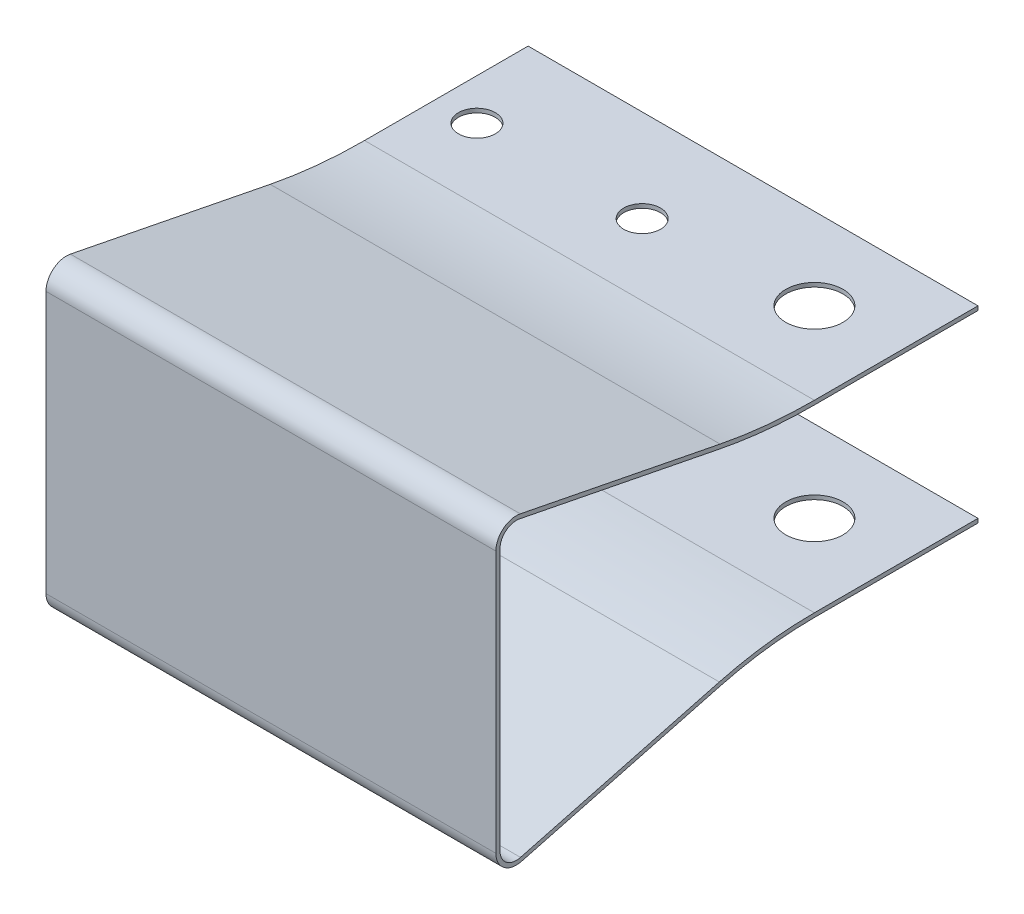
ISO-10303-21;
HEADER;
FILE_DESCRIPTION(('STEP AP214'),'2;1');
FILE_NAME('part.step','',(''),(''),'','','');
FILE_SCHEMA(('AUTOMOTIVE_DESIGN { 1 0 10303 214 1 1 1 1 }'));
ENDSEC;
DATA;
#1=APPLICATION_CONTEXT('core data for automotive mechanical design processes');
#2=APPLICATION_PROTOCOL_DEFINITION('international standard','automotive_design',2000,#1);
#3=PRODUCT_CONTEXT('',#1,'mechanical');
#4=PRODUCT('Part','Part','',(#3));
#5=PRODUCT_RELATED_PRODUCT_CATEGORY('part','',(#4));
#6=PRODUCT_DEFINITION_FORMATION('','',#4);
#7=PRODUCT_DEFINITION_CONTEXT('part definition',#1,'design');
#8=PRODUCT_DEFINITION('design','',#6,#7);
#9=PRODUCT_DEFINITION_SHAPE('','',#8);
#10=(LENGTH_UNIT() NAMED_UNIT(*) SI_UNIT(.MILLI.,.METRE.));
#11=(NAMED_UNIT(*) PLANE_ANGLE_UNIT() SI_UNIT($,.RADIAN.));
#12=(NAMED_UNIT(*) SI_UNIT($,.STERADIAN.) SOLID_ANGLE_UNIT());
#13=UNCERTAINTY_MEASURE_WITH_UNIT(LENGTH_MEASURE(1.E-05),#10,'distance_accuracy_value','');
#14=(GEOMETRIC_REPRESENTATION_CONTEXT(3) GLOBAL_UNCERTAINTY_ASSIGNED_CONTEXT((#13)) GLOBAL_UNIT_ASSIGNED_CONTEXT((#10,
#11,#12)) REPRESENTATION_CONTEXT('',''));
#15=CARTESIAN_POINT('',(0.,0.,0.));
#16=DIRECTION('',(0.,0.,1.));
#17=DIRECTION('',(1.,0.,0.));
#18=AXIS2_PLACEMENT_3D('',#15,#16,#17);
#19=CARTESIAN_POINT('',(13.75,8.,23.22));
#20=DIRECTION('',(-1.,0.,0.));
#21=DIRECTION('',(0.,0.,1.));
#22=AXIS2_PLACEMENT_3D('',#19,#20,#21);
#23=CYLINDRICAL_SURFACE('',#22,1.);
#24=CARTESIAN_POINT('',(-13.75,8.,23.22));
#25=DIRECTION('',(-1.,0.,0.));
#26=DIRECTION('',(0.,0.,-1.));
#27=AXIS2_PLACEMENT_3D('',#24,#25,#26);
#28=CIRCLE('',#27,1.);
#29=CARTESIAN_POINT('',(-13.75,8.,24.22));
#30=VERTEX_POINT('',#29);
#31=CARTESIAN_POINT('',(-13.75,8.98104394957776,23.0262146316233));
#32=VERTEX_POINT('',#31);
#33=EDGE_CURVE('E202',#30,#32,#28,.T.);
#34=ORIENTED_EDGE('',*,*,#33,.T.);
#35=DIRECTION('',(-1.,0.,0.));
#36=VECTOR('',#35,1.);
#37=CARTESIAN_POINT('',(13.75,8.98104394957776,23.0262146316233));
#38=LINE('',#37,#36);
#39=CARTESIAN_POINT('',(13.75,8.98104394957776,23.0262146316233));
#40=VERTEX_POINT('',#39);
#41=EDGE_CURVE('E11',#40,#32,#38,.T.);
#42=ORIENTED_EDGE('',*,*,#41,.F.);
#43=CARTESIAN_POINT('',(13.75,8.,23.22));
#44=DIRECTION('',(-1.,0.,0.));
#45=DIRECTION('',(0.,0.,-1.));
#46=AXIS2_PLACEMENT_3D('',#43,#44,#45);
#47=CIRCLE('',#46,1.);
#48=CARTESIAN_POINT('',(13.75,8.,24.22));
#49=VERTEX_POINT('',#48);
#50=EDGE_CURVE('E241',#49,#40,#47,.T.);
#51=ORIENTED_EDGE('',*,*,#50,.F.);
#52=DIRECTION('',(-1.,0.,0.));
#53=VECTOR('',#52,1.);
#54=CARTESIAN_POINT('',(13.75,8.,24.22));
#55=LINE('',#54,#53);
#56=EDGE_CURVE('E198',#49,#30,#55,.T.);
#57=ORIENTED_EDGE('',*,*,#56,.T.);
#58=EDGE_LOOP('',(#34,#42,#51,#57));
#59=FACE_BOUND('',#58,.T.);
#60=ADVANCED_FACE('F32',(#59),#23,.F.);
#61=CARTESIAN_POINT('',(13.75,6.56868151266737,10.8135610513));
#62=DIRECTION('',(0.,0.981043949577755,-0.193785368376667));
#63=DIRECTION('',(0.,0.193785368376667,0.981043949577754));
#64=AXIS2_PLACEMENT_3D('',#61,#62,#63);
#65=PLANE('',#64);
#66=DIRECTION('',(0.,-0.193785368376667,-0.981043949577754));
#67=VECTOR('',#66,1.);
#68=CARTESIAN_POINT('',(-13.75,6.56868151266737,10.8135610513));
#69=LINE('',#68,#67);
#70=CARTESIAN_POINT('',(-13.75,6.56868151266737,10.8135610513));
#71=VERTEX_POINT('',#70);
#72=EDGE_CURVE('E205',#32,#71,#69,.T.);
#73=ORIENTED_EDGE('',*,*,#72,.T.);
#74=DIRECTION('',(-1.,0.,0.));
#75=VECTOR('',#74,1.);
#76=CARTESIAN_POINT('',(13.75,6.56868151266737,10.8135610513));
#77=LINE('',#76,#75);
#78=CARTESIAN_POINT('',(13.75,6.56868151266737,10.8135610513));
#79=VERTEX_POINT('',#78);
#80=EDGE_CURVE('E41',#79,#71,#77,.T.);
#81=ORIENTED_EDGE('',*,*,#80,.F.);
#82=DIRECTION('',(0.,-0.193785368376667,-0.981043949577754));
#83=VECTOR('',#82,1.);
#84=CARTESIAN_POINT('',(13.75,6.56868151266737,10.8135610513));
#85=LINE('',#84,#83);
#86=EDGE_CURVE('E129',#40,#79,#85,.T.);
#87=ORIENTED_EDGE('',*,*,#86,.F.);
#88=ORIENTED_EDGE('',*,*,#41,.T.);
#89=EDGE_LOOP('',(#73,#81,#87,#88));
#90=FACE_BOUND('',#89,.T.);
#91=ADVANCED_FACE('F380',(#90),#65,.F.);
#92=CARTESIAN_POINT('',(13.75,36.,5.));
#93=DIRECTION('',(-1.,0.,0.));
#94=DIRECTION('',(0.,0.,1.));
#95=AXIS2_PLACEMENT_3D('',#92,#93,#94);
#96=CYLINDRICAL_SURFACE('',#95,30.);
#97=CARTESIAN_POINT('',(-13.75,36.,5.));
#98=DIRECTION('',(1.,0.,0.));
#99=DIRECTION('',(0.,0.,1.));
#100=AXIS2_PLACEMENT_3D('',#97,#98,#99);
#101=CIRCLE('',#100,30.);
#102=CARTESIAN_POINT('',(-13.75,6.,5.));
#103=VERTEX_POINT('',#102);
#104=EDGE_CURVE('E208',#71,#103,#101,.T.);
#105=ORIENTED_EDGE('',*,*,#104,.T.);
#106=DIRECTION('',(-1.,0.,0.));
#107=VECTOR('',#106,1.);
#108=CARTESIAN_POINT('',(13.75,6.,5.));
#109=LINE('',#108,#107);
#110=CARTESIAN_POINT('',(13.75,6.,5.));
#111=VERTEX_POINT('',#110);
#112=EDGE_CURVE('E284',#111,#103,#109,.T.);
#113=ORIENTED_EDGE('',*,*,#112,.F.);
#114=CARTESIAN_POINT('',(13.75,36.,5.));
#115=DIRECTION('',(1.,0.,0.));
#116=DIRECTION('',(0.,0.,1.));
#117=AXIS2_PLACEMENT_3D('',#114,#115,#116);
#118=CIRCLE('',#117,30.);
#119=EDGE_CURVE('E325',#79,#111,#118,.T.);
#120=ORIENTED_EDGE('',*,*,#119,.F.);
#121=ORIENTED_EDGE('',*,*,#80,.T.);
#122=EDGE_LOOP('',(#105,#113,#120,#121));
#123=FACE_BOUND('',#122,.T.);
#124=ADVANCED_FACE('F384',(#123),#96,.T.);
#125=CARTESIAN_POINT('',(13.75,6.,5.));
#126=DIRECTION('',(0.,1.,0.));
#127=DIRECTION('',(0.,0.,1.));
#128=AXIS2_PLACEMENT_3D('',#125,#126,#127);
#129=PLANE('',#128);
#130=CARTESIAN_POINT('',(-11.23,6.,0.650000000000002));
#131=DIRECTION('',(0.,1.,0.));
#132=DIRECTION('',(0.,0.,1.));
#133=AXIS2_PLACEMENT_3D('',#130,#131,#132);
#134=CIRCLE('',#133,1.125);
#135=CARTESIAN_POINT('',(-11.23,6.,1.775));
#136=VERTEX_POINT('',#135);
#137=EDGE_CURVE('E296',#136,#136,#134,.T.);
#138=ORIENTED_EDGE('',*,*,#137,.T.);
#139=EDGE_LOOP('',(#138));
#140=FACE_BOUND('',#139,.T.);
#141=CARTESIAN_POINT('',(-1.13,6.,0.650000000000001));
#142=DIRECTION('',(0.,1.,0.));
#143=DIRECTION('',(0.,0.,1.));
#144=AXIS2_PLACEMENT_3D('',#141,#142,#143);
#145=CIRCLE('',#144,1.125);
#146=CARTESIAN_POINT('',(-1.13,6.,1.775));
#147=VERTEX_POINT('',#146);
#148=EDGE_CURVE('E292',#147,#147,#145,.T.);
#149=ORIENTED_EDGE('',*,*,#148,.T.);
#150=EDGE_LOOP('',(#149));
#151=FACE_BOUND('',#150,.T.);
#152=CARTESIAN_POINT('',(8.75,6.,0.));
#153=DIRECTION('',(0.,1.,0.));
#154=DIRECTION('',(0.,0.,1.));
#155=AXIS2_PLACEMENT_3D('',#152,#153,#154);
#156=CIRCLE('',#155,1.75);
#157=CARTESIAN_POINT('',(8.75,6.,1.75));
#158=VERTEX_POINT('',#157);
#159=EDGE_CURVE('E206',#158,#158,#156,.T.);
#160=ORIENTED_EDGE('',*,*,#159,.T.);
#161=EDGE_LOOP('',(#160));
#162=FACE_BOUND('',#161,.T.);
#163=DIRECTION('',(0.,0.,-1.));
#164=VECTOR('',#163,1.);
#165=CARTESIAN_POINT('',(-13.75,6.,5.));
#166=LINE('',#165,#164);
#167=CARTESIAN_POINT('',(-13.75,6.,-5.));
#168=VERTEX_POINT('',#167);
#169=EDGE_CURVE('E210',#103,#168,#166,.T.);
#170=ORIENTED_EDGE('',*,*,#169,.T.);
#171=DIRECTION('',(-1.,0.,0.));
#172=VECTOR('',#171,1.);
#173=CARTESIAN_POINT('',(13.75,6.,-5.));
#174=LINE('',#173,#172);
#175=CARTESIAN_POINT('',(13.75,6.,-5.));
#176=VERTEX_POINT('',#175);
#177=EDGE_CURVE('E281',#176,#168,#174,.T.);
#178=ORIENTED_EDGE('',*,*,#177,.F.);
#179=DIRECTION('',(0.,0.,-1.));
#180=VECTOR('',#179,1.);
#181=CARTESIAN_POINT('',(13.75,6.,5.));
#182=LINE('',#181,#180);
#183=EDGE_CURVE('E327',#111,#176,#182,.T.);
#184=ORIENTED_EDGE('',*,*,#183,.F.);
#185=ORIENTED_EDGE('',*,*,#112,.T.);
#186=EDGE_LOOP('',(#170,#178,#184,#185));
#187=FACE_BOUND('',#186,.T.);
#188=ADVANCED_FACE('F388',(#140,#151,#162,#187),#129,.F.);
#189=CARTESIAN_POINT('',(13.75,6.25,-5.));
#190=DIRECTION('',(0.,0.,1.));
#191=DIRECTION('',(1.,0.,0.));
#192=AXIS2_PLACEMENT_3D('',#189,#190,#191);
#193=PLANE('',#192);
#194=DIRECTION('',(0.,1.,0.));
#195=VECTOR('',#194,1.);
#196=CARTESIAN_POINT('',(-13.75,6.25,-5.));
#197=LINE('',#196,#195);
#198=CARTESIAN_POINT('',(-13.75,6.25,-5.));
#199=VERTEX_POINT('',#198);
#200=EDGE_CURVE('E212',#168,#199,#197,.T.);
#201=ORIENTED_EDGE('',*,*,#200,.T.);
#202=DIRECTION('',(-1.,0.,0.));
#203=VECTOR('',#202,1.);
#204=CARTESIAN_POINT('',(13.75,6.25,-5.));
#205=LINE('',#204,#203);
#206=CARTESIAN_POINT('',(13.75,6.25,-5.));
#207=VERTEX_POINT('',#206);
#208=EDGE_CURVE('E278',#207,#199,#205,.T.);
#209=ORIENTED_EDGE('',*,*,#208,.F.);
#210=DIRECTION('',(0.,1.,0.));
#211=VECTOR('',#210,1.);
#212=CARTESIAN_POINT('',(13.75,6.25,-5.));
#213=LINE('',#212,#211);
#214=EDGE_CURVE('E329',#176,#207,#213,.T.);
#215=ORIENTED_EDGE('',*,*,#214,.F.);
#216=ORIENTED_EDGE('',*,*,#177,.T.);
#217=EDGE_LOOP('',(#201,#209,#215,#216));
#218=FACE_BOUND('',#217,.T.);
#219=ADVANCED_FACE('F394',(#218),#193,.F.);
#220=CARTESIAN_POINT('',(13.75,6.25,5.));
#221=DIRECTION('',(0.,-1.,0.));
#222=DIRECTION('',(0.,0.,-1.));
#223=AXIS2_PLACEMENT_3D('',#220,#221,#222);
#224=PLANE('',#223);
#225=CARTESIAN_POINT('',(-11.23,6.25,0.650000000000002));
#226=DIRECTION('',(0.,-1.,0.));
#227=DIRECTION('',(0.,0.,-1.));
#228=AXIS2_PLACEMENT_3D('',#225,#226,#227);
#229=CIRCLE('',#228,1.125);
#230=CARTESIAN_POINT('',(-11.23,6.25,-0.475));
#231=VERTEX_POINT('',#230);
#232=EDGE_CURVE('E303',#231,#231,#229,.T.);
#233=ORIENTED_EDGE('',*,*,#232,.T.);
#234=EDGE_LOOP('',(#233));
#235=FACE_BOUND('',#234,.T.);
#236=CARTESIAN_POINT('',(-1.13,6.25,0.650000000000001));
#237=DIRECTION('',(0.,-1.,0.));
#238=DIRECTION('',(0.,0.,-1.));
#239=AXIS2_PLACEMENT_3D('',#236,#237,#238);
#240=CIRCLE('',#239,1.125);
#241=CARTESIAN_POINT('',(-1.13,6.25,-0.474999999999999));
#242=VERTEX_POINT('',#241);
#243=EDGE_CURVE('E300',#242,#242,#240,.T.);
#244=ORIENTED_EDGE('',*,*,#243,.T.);
#245=EDGE_LOOP('',(#244));
#246=FACE_BOUND('',#245,.T.);
#247=CARTESIAN_POINT('',(8.75,6.25,0.));
#248=DIRECTION('',(0.,-1.,0.));
#249=DIRECTION('',(0.,0.,-1.));
#250=AXIS2_PLACEMENT_3D('',#247,#248,#249);
#251=CIRCLE('',#250,1.75);
#252=CARTESIAN_POINT('',(8.75,6.25,-1.75));
#253=VERTEX_POINT('',#252);
#254=EDGE_CURVE('E318',#253,#253,#251,.T.);
#255=ORIENTED_EDGE('',*,*,#254,.T.);
#256=EDGE_LOOP('',(#255));
#257=FACE_BOUND('',#256,.T.);
#258=DIRECTION('',(0.,0.,1.));
#259=VECTOR('',#258,1.);
#260=CARTESIAN_POINT('',(-13.75,6.25,5.));
#261=LINE('',#260,#259);
#262=CARTESIAN_POINT('',(-13.75,6.25,4.99999999999999));
#263=VERTEX_POINT('',#262);
#264=EDGE_CURVE('E214',#199,#263,#261,.T.);
#265=ORIENTED_EDGE('',*,*,#264,.T.);
#266=DIRECTION('',(-1.,0.,0.));
#267=VECTOR('',#266,1.);
#268=CARTESIAN_POINT('',(13.75,6.25,4.99999999999999));
#269=LINE('',#268,#267);
#270=CARTESIAN_POINT('',(13.75,6.25,4.99999999999999));
#271=VERTEX_POINT('',#270);
#272=EDGE_CURVE('E275',#271,#263,#269,.T.);
#273=ORIENTED_EDGE('',*,*,#272,.F.);
#274=DIRECTION('',(0.,0.,1.));
#275=VECTOR('',#274,1.);
#276=CARTESIAN_POINT('',(13.75,6.25,5.));
#277=LINE('',#276,#275);
#278=EDGE_CURVE('E331',#207,#271,#277,.T.);
#279=ORIENTED_EDGE('',*,*,#278,.F.);
#280=ORIENTED_EDGE('',*,*,#208,.T.);
#281=EDGE_LOOP('',(#265,#273,#279,#280));
#282=FACE_BOUND('',#281,.T.);
#283=ADVANCED_FACE('F397',(#235,#246,#257,#282),#224,.F.);
#284=CARTESIAN_POINT('',(13.75,36.,5.));
#285=DIRECTION('',(-1.,0.,0.));
#286=DIRECTION('',(0.,0.,1.));
#287=AXIS2_PLACEMENT_3D('',#284,#285,#286);
#288=CYLINDRICAL_SURFACE('',#287,29.75);
#289=CARTESIAN_POINT('',(-13.75,36.,5.));
#290=DIRECTION('',(-1.,0.,0.));
#291=DIRECTION('',(0.,0.,1.));
#292=AXIS2_PLACEMENT_3D('',#289,#290,#291);
#293=CIRCLE('',#292,29.75);
#294=CARTESIAN_POINT('',(-13.75,6.81394250006181,10.7651147092058));
#295=VERTEX_POINT('',#294);
#296=EDGE_CURVE('E216',#263,#295,#293,.T.);
#297=ORIENTED_EDGE('',*,*,#296,.T.);
#298=DIRECTION('',(-1.,0.,0.));
#299=VECTOR('',#298,1.);
#300=CARTESIAN_POINT('',(13.75,6.81394250006181,10.7651147092058));
#301=LINE('',#300,#299);
#302=CARTESIAN_POINT('',(13.75,6.81394250006181,10.7651147092058));
#303=VERTEX_POINT('',#302);
#304=EDGE_CURVE('E272',#303,#295,#301,.T.);
#305=ORIENTED_EDGE('',*,*,#304,.F.);
#306=CARTESIAN_POINT('',(13.75,36.,5.));
#307=DIRECTION('',(-1.,0.,0.));
#308=DIRECTION('',(0.,0.,1.));
#309=AXIS2_PLACEMENT_3D('',#306,#307,#308);
#310=CIRCLE('',#309,29.75);
#311=EDGE_CURVE('E333',#271,#303,#310,.T.);
#312=ORIENTED_EDGE('',*,*,#311,.F.);
#313=ORIENTED_EDGE('',*,*,#272,.T.);
#314=EDGE_LOOP('',(#297,#305,#312,#313));
#315=FACE_BOUND('',#314,.T.);
#316=ADVANCED_FACE('F401',(#315),#288,.F.);
#317=CARTESIAN_POINT('',(13.75,6.81394250006181,10.7651147092058));
#318=DIRECTION('',(0.,-0.981043949577754,0.193785368376668));
#319=DIRECTION('',(0.,-0.193785368376668,-0.981043949577754));
#320=AXIS2_PLACEMENT_3D('',#317,#318,#319);
#321=PLANE('',#320);
#322=DIRECTION('',(0.,0.193785368376668,0.981043949577754));
#323=VECTOR('',#322,1.);
#324=CARTESIAN_POINT('',(-13.75,6.81394250006181,10.7651147092058));
#325=LINE('',#324,#323);
#326=CARTESIAN_POINT('',(-13.75,9.22630493697219,22.9777682895292));
#327=VERTEX_POINT('',#326);
#328=EDGE_CURVE('E218',#295,#327,#325,.T.);
#329=ORIENTED_EDGE('',*,*,#328,.T.);
#330=DIRECTION('',(-1.,0.,0.));
#331=VECTOR('',#330,1.);
#332=CARTESIAN_POINT('',(13.75,9.22630493697219,22.9777682895292));
#333=LINE('',#332,#331);
#334=CARTESIAN_POINT('',(13.75,9.22630493697219,22.9777682895292));
#335=VERTEX_POINT('',#334);
#336=EDGE_CURVE('E269',#335,#327,#333,.T.);
#337=ORIENTED_EDGE('',*,*,#336,.F.);
#338=DIRECTION('',(0.,0.193785368376668,0.981043949577754));
#339=VECTOR('',#338,1.);
#340=CARTESIAN_POINT('',(13.75,6.81394250006181,10.7651147092058));
#341=LINE('',#340,#339);
#342=EDGE_CURVE('E335',#303,#335,#341,.T.);
#343=ORIENTED_EDGE('',*,*,#342,.F.);
#344=ORIENTED_EDGE('',*,*,#304,.T.);
#345=EDGE_LOOP('',(#329,#337,#343,#344));
#346=FACE_BOUND('',#345,.T.);
#347=ADVANCED_FACE('F405',(#346),#321,.F.);
#348=CARTESIAN_POINT('',(13.75,8.,23.22));
#349=DIRECTION('',(-1.,0.,0.));
#350=DIRECTION('',(0.,0.,1.));
#351=AXIS2_PLACEMENT_3D('',#348,#349,#350);
#352=CYLINDRICAL_SURFACE('',#351,1.25);
#353=CARTESIAN_POINT('',(-13.75,8.,23.22));
#354=DIRECTION('',(1.,0.,0.));
#355=DIRECTION('',(0.,0.,-1.));
#356=AXIS2_PLACEMENT_3D('',#353,#354,#355);
#357=CIRCLE('',#356,1.25);
#358=CARTESIAN_POINT('',(-13.75,8.,24.47));
#359=VERTEX_POINT('',#358);
#360=EDGE_CURVE('E220',#327,#359,#357,.T.);
#361=ORIENTED_EDGE('',*,*,#360,.T.);
#362=DIRECTION('',(-1.,0.,0.));
#363=VECTOR('',#362,1.);
#364=CARTESIAN_POINT('',(13.75,8.,24.47));
#365=LINE('',#364,#363);
#366=CARTESIAN_POINT('',(13.75,8.,24.47));
#367=VERTEX_POINT('',#366);
#368=EDGE_CURVE('E266',#367,#359,#365,.T.);
#369=ORIENTED_EDGE('',*,*,#368,.F.);
#370=CARTESIAN_POINT('',(13.75,8.,23.22));
#371=DIRECTION('',(1.,0.,0.));
#372=DIRECTION('',(0.,0.,-1.));
#373=AXIS2_PLACEMENT_3D('',#370,#371,#372);
#374=CIRCLE('',#373,1.25);
#375=EDGE_CURVE('E337',#335,#367,#374,.T.);
#376=ORIENTED_EDGE('',*,*,#375,.F.);
#377=ORIENTED_EDGE('',*,*,#336,.T.);
#378=EDGE_LOOP('',(#361,#369,#376,#377));
#379=FACE_BOUND('',#378,.T.);
#380=ADVANCED_FACE('F409',(#379),#352,.T.);
#381=CARTESIAN_POINT('',(13.75,8.,24.47));
#382=DIRECTION('',(0.,0.,-1.));
#383=DIRECTION('',(-1.,0.,0.));
#384=AXIS2_PLACEMENT_3D('',#381,#382,#383);
#385=PLANE('',#384);
#386=DIRECTION('',(0.,-1.,0.));
#387=VECTOR('',#386,1.);
#388=CARTESIAN_POINT('',(-13.75,8.,24.47));
#389=LINE('',#388,#387);
#390=CARTESIAN_POINT('',(-13.75,-8.,24.47));
#391=VERTEX_POINT('',#390);
#392=EDGE_CURVE('E222',#359,#391,#389,.T.);
#393=ORIENTED_EDGE('',*,*,#392,.T.);
#394=DIRECTION('',(-1.,0.,0.));
#395=VECTOR('',#394,1.);
#396=CARTESIAN_POINT('',(13.75,-8.,24.47));
#397=LINE('',#396,#395);
#398=CARTESIAN_POINT('',(13.75,-8.,24.47));
#399=VERTEX_POINT('',#398);
#400=EDGE_CURVE('E263',#399,#391,#397,.T.);
#401=ORIENTED_EDGE('',*,*,#400,.F.);
#402=DIRECTION('',(0.,-1.,0.));
#403=VECTOR('',#402,1.);
#404=CARTESIAN_POINT('',(13.75,8.,24.47));
#405=LINE('',#404,#403);
#406=EDGE_CURVE('E339',#367,#399,#405,.T.);
#407=ORIENTED_EDGE('',*,*,#406,.F.);
#408=ORIENTED_EDGE('',*,*,#368,.T.);
#409=EDGE_LOOP('',(#393,#401,#407,#408));
#410=FACE_BOUND('',#409,.T.);
#411=ADVANCED_FACE('F413',(#410),#385,.F.);
#412=CARTESIAN_POINT('',(13.75,-8.,23.22));
#413=DIRECTION('',(-1.,0.,0.));
#414=DIRECTION('',(0.,0.,1.));
#415=AXIS2_PLACEMENT_3D('',#412,#413,#414);
#416=CYLINDRICAL_SURFACE('',#415,1.25);
#417=CARTESIAN_POINT('',(-13.75,-8.,23.22));
#418=DIRECTION('',(1.,0.,0.));
#419=DIRECTION('',(0.,0.,-1.));
#420=AXIS2_PLACEMENT_3D('',#417,#418,#419);
#421=CIRCLE('',#420,1.25);
#422=CARTESIAN_POINT('',(-13.75,-9.20850235944556,22.9005910971583));
#423=VERTEX_POINT('',#422);
#424=EDGE_CURVE('E224',#391,#423,#421,.T.);
#425=ORIENTED_EDGE('',*,*,#424,.T.);
#426=DIRECTION('',(-1.,0.,0.));
#427=VECTOR('',#426,1.);
#428=CARTESIAN_POINT('',(13.75,-9.20850235944556,22.9005910971583));
#429=LINE('',#428,#427);
#430=CARTESIAN_POINT('',(13.75,-9.20850235944556,22.9005910971583));
#431=VERTEX_POINT('',#430);
#432=EDGE_CURVE('E260',#431,#423,#429,.T.);
#433=ORIENTED_EDGE('',*,*,#432,.F.);
#434=CARTESIAN_POINT('',(13.75,-8.,23.22));
#435=DIRECTION('',(1.,0.,0.));
#436=DIRECTION('',(0.,0.,-1.));
#437=AXIS2_PLACEMENT_3D('',#434,#435,#436);
#438=CIRCLE('',#437,1.25);
#439=EDGE_CURVE('E341',#399,#431,#438,.T.);
#440=ORIENTED_EDGE('',*,*,#439,.F.);
#441=ORIENTED_EDGE('',*,*,#400,.T.);
#442=EDGE_LOOP('',(#425,#433,#440,#441));
#443=FACE_BOUND('',#442,.T.);
#444=ADVANCED_FACE('F417',(#443),#416,.T.);
#445=CARTESIAN_POINT('',(13.75,-5.99699897703984,10.7496792707317));
#446=DIRECTION('',(0.,0.966801887556448,0.255527122273329));
#447=DIRECTION('',(0.,-0.255527122273329,0.966801887556448));
#448=AXIS2_PLACEMENT_3D('',#445,#446,#447);
#449=PLANE('',#448);
#450=DIRECTION('',(0.,0.255527122273329,-0.966801887556448));
#451=VECTOR('',#450,1.);
#452=CARTESIAN_POINT('',(-13.75,-5.99699897703984,10.7496792707317));
#453=LINE('',#452,#451);
#454=CARTESIAN_POINT('',(-13.75,-5.99699897703983,10.7496792707317));
#455=VERTEX_POINT('',#454);
#456=EDGE_CURVE('E226',#423,#455,#453,.T.);
#457=ORIENTED_EDGE('',*,*,#456,.T.);
#458=DIRECTION('',(-1.,0.,0.));
#459=VECTOR('',#458,1.);
#460=CARTESIAN_POINT('',(13.75,-5.99699897703983,10.7496792707317));
#461=LINE('',#460,#459);
#462=CARTESIAN_POINT('',(13.75,-5.99699897703983,10.7496792707317));
#463=VERTEX_POINT('',#462);
#464=EDGE_CURVE('E257',#463,#455,#461,.T.);
#465=ORIENTED_EDGE('',*,*,#464,.F.);
#466=DIRECTION('',(0.,0.255527122273329,-0.966801887556448));
#467=VECTOR('',#466,1.);
#468=CARTESIAN_POINT('',(13.75,-5.99699897703984,10.7496792707317));
#469=LINE('',#468,#467);
#470=EDGE_CURVE('E343',#431,#463,#469,.T.);
#471=ORIENTED_EDGE('',*,*,#470,.F.);
#472=ORIENTED_EDGE('',*,*,#432,.T.);
#473=EDGE_LOOP('',(#457,#465,#471,#472));
#474=FACE_BOUND('',#473,.T.);
#475=ADVANCED_FACE('F421',(#474),#449,.F.);
#476=CARTESIAN_POINT('',(13.75,-27.7512484764001,5.));
#477=DIRECTION('',(-1.,0.,0.));
#478=DIRECTION('',(0.,0.,1.));
#479=AXIS2_PLACEMENT_3D('',#476,#477,#478);
#480=CYLINDRICAL_SURFACE('',#479,22.5012484764001);
#481=CARTESIAN_POINT('',(-13.75,-27.7512484764001,5.));
#482=DIRECTION('',(-1.,0.,0.));
#483=DIRECTION('',(0.,0.,-1.));
#484=AXIS2_PLACEMENT_3D('',#481,#482,#483);
#485=CIRCLE('',#484,22.5012484764001);
#486=CARTESIAN_POINT('',(-13.75,-5.25,5.));
#487=VERTEX_POINT('',#486);
#488=EDGE_CURVE('E228',#455,#487,#485,.T.);
#489=ORIENTED_EDGE('',*,*,#488,.T.);
#490=DIRECTION('',(-1.,0.,0.));
#491=VECTOR('',#490,1.);
#492=CARTESIAN_POINT('',(13.75,-5.25,5.));
#493=LINE('',#492,#491);
#494=CARTESIAN_POINT('',(13.75,-5.25,5.));
#495=VERTEX_POINT('',#494);
#496=EDGE_CURVE('E254',#495,#487,#493,.T.);
#497=ORIENTED_EDGE('',*,*,#496,.F.);
#498=CARTESIAN_POINT('',(13.75,-27.7512484764001,5.));
#499=DIRECTION('',(-1.,0.,0.));
#500=DIRECTION('',(0.,0.,-1.));
#501=AXIS2_PLACEMENT_3D('',#498,#499,#500);
#502=CIRCLE('',#501,22.5012484764001);
#503=EDGE_CURVE('E345',#463,#495,#502,.T.);
#504=ORIENTED_EDGE('',*,*,#503,.F.);
#505=ORIENTED_EDGE('',*,*,#464,.T.);
#506=EDGE_LOOP('',(#489,#497,#504,#505));
#507=FACE_BOUND('',#506,.T.);
#508=ADVANCED_FACE('F425',(#507),#480,.F.);
#509=CARTESIAN_POINT('',(13.75,-5.25,5.));
#510=DIRECTION('',(0.,1.,0.));
#511=DIRECTION('',(0.,0.,1.));
#512=AXIS2_PLACEMENT_3D('',#509,#510,#511);
#513=PLANE('',#512);
#514=CARTESIAN_POINT('',(-11.23,-5.25,0.650000000000002));
#515=DIRECTION('',(0.,1.,0.));
#516=DIRECTION('',(0.,0.,1.));
#517=AXIS2_PLACEMENT_3D('',#514,#515,#516);
#518=CIRCLE('',#517,1.125);
#519=CARTESIAN_POINT('',(-11.23,-5.25,1.775));
#520=VERTEX_POINT('',#519);
#521=EDGE_CURVE('E308',#520,#520,#518,.T.);
#522=ORIENTED_EDGE('',*,*,#521,.T.);
#523=EDGE_LOOP('',(#522));
#524=FACE_BOUND('',#523,.T.);
#525=CARTESIAN_POINT('',(-1.13,-5.25,0.650000000000001));
#526=DIRECTION('',(0.,1.,0.));
#527=DIRECTION('',(0.,0.,1.));
#528=AXIS2_PLACEMENT_3D('',#525,#526,#527);
#529=CIRCLE('',#528,1.125);
#530=CARTESIAN_POINT('',(-1.13,-5.25,1.775));
#531=VERTEX_POINT('',#530);
#532=EDGE_CURVE('E295',#531,#531,#529,.T.);
#533=ORIENTED_EDGE('',*,*,#532,.T.);
#534=EDGE_LOOP('',(#533));
#535=FACE_BOUND('',#534,.T.);
#536=CARTESIAN_POINT('',(8.75,-5.25,0.));
#537=DIRECTION('',(0.,1.,0.));
#538=DIRECTION('',(0.,0.,1.));
#539=AXIS2_PLACEMENT_3D('',#536,#537,#538);
#540=CIRCLE('',#539,1.75);
#541=CARTESIAN_POINT('',(8.75,-5.25,1.75));
#542=VERTEX_POINT('',#541);
#543=EDGE_CURVE('E291',#542,#542,#540,.T.);
#544=ORIENTED_EDGE('',*,*,#543,.T.);
#545=EDGE_LOOP('',(#544));
#546=FACE_BOUND('',#545,.T.);
#547=DIRECTION('',(0.,0.,-1.));
#548=VECTOR('',#547,1.);
#549=CARTESIAN_POINT('',(-13.75,-5.25,5.));
#550=LINE('',#549,#548);
#551=CARTESIAN_POINT('',(-13.75,-5.25,-5.));
#552=VERTEX_POINT('',#551);
#553=EDGE_CURVE('E230',#487,#552,#550,.T.);
#554=ORIENTED_EDGE('',*,*,#553,.T.);
#555=DIRECTION('',(-1.,0.,0.));
#556=VECTOR('',#555,1.);
#557=CARTESIAN_POINT('',(13.75,-5.25,-5.));
#558=LINE('',#557,#556);
#559=CARTESIAN_POINT('',(13.75,-5.25,-5.));
#560=VERTEX_POINT('',#559);
#561=EDGE_CURVE('E251',#560,#552,#558,.T.);
#562=ORIENTED_EDGE('',*,*,#561,.F.);
#563=DIRECTION('',(0.,0.,-1.));
#564=VECTOR('',#563,1.);
#565=CARTESIAN_POINT('',(13.75,-5.25,5.));
#566=LINE('',#565,#564);
#567=EDGE_CURVE('E347',#495,#560,#566,.T.);
#568=ORIENTED_EDGE('',*,*,#567,.F.);
#569=ORIENTED_EDGE('',*,*,#496,.T.);
#570=EDGE_LOOP('',(#554,#562,#568,#569));
#571=FACE_BOUND('',#570,.T.);
#572=ADVANCED_FACE('F429',(#524,#535,#546,#571),#513,.F.);
#573=CARTESIAN_POINT('',(13.75,-5.,-5.));
#574=DIRECTION('',(0.,0.,1.));
#575=DIRECTION('',(1.,0.,0.));
#576=AXIS2_PLACEMENT_3D('',#573,#574,#575);
#577=PLANE('',#576);
#578=DIRECTION('',(0.,1.,0.));
#579=VECTOR('',#578,1.);
#580=CARTESIAN_POINT('',(-13.75,-5.,-5.));
#581=LINE('',#580,#579);
#582=CARTESIAN_POINT('',(-13.75,-5.,-5.));
#583=VERTEX_POINT('',#582);
#584=EDGE_CURVE('E232',#552,#583,#581,.T.);
#585=ORIENTED_EDGE('',*,*,#584,.T.);
#586=DIRECTION('',(-1.,0.,0.));
#587=VECTOR('',#586,1.);
#588=CARTESIAN_POINT('',(13.75,-5.,-5.));
#589=LINE('',#588,#587);
#590=CARTESIAN_POINT('',(13.75,-5.,-5.));
#591=VERTEX_POINT('',#590);
#592=EDGE_CURVE('E248',#591,#583,#589,.T.);
#593=ORIENTED_EDGE('',*,*,#592,.F.);
#594=DIRECTION('',(0.,1.,0.));
#595=VECTOR('',#594,1.);
#596=CARTESIAN_POINT('',(13.75,-5.,-5.));
#597=LINE('',#596,#595);
#598=EDGE_CURVE('E349',#560,#591,#597,.T.);
#599=ORIENTED_EDGE('',*,*,#598,.F.);
#600=ORIENTED_EDGE('',*,*,#561,.T.);
#601=EDGE_LOOP('',(#585,#593,#599,#600));
#602=FACE_BOUND('',#601,.T.);
#603=ADVANCED_FACE('F433',(#602),#577,.F.);
#604=CARTESIAN_POINT('',(13.75,-5.,5.));
#605=DIRECTION('',(0.,-1.,0.));
#606=DIRECTION('',(0.,0.,-1.));
#607=AXIS2_PLACEMENT_3D('',#604,#605,#606);
#608=PLANE('',#607);
#609=CARTESIAN_POINT('',(-11.23,-5.,0.650000000000002));
#610=DIRECTION('',(0.,-1.,0.));
#611=DIRECTION('',(0.,0.,-1.));
#612=AXIS2_PLACEMENT_3D('',#609,#610,#611);
#613=CIRCLE('',#612,1.125);
#614=CARTESIAN_POINT('',(-11.23,-5.,-0.475));
#615=VERTEX_POINT('',#614);
#616=EDGE_CURVE('E35',#615,#615,#613,.T.);
#617=ORIENTED_EDGE('',*,*,#616,.T.);
#618=EDGE_LOOP('',(#617));
#619=FACE_BOUND('',#618,.T.);
#620=CARTESIAN_POINT('',(-1.13,-5.,0.650000000000001));
#621=DIRECTION('',(0.,-1.,0.));
#622=DIRECTION('',(0.,0.,-1.));
#623=AXIS2_PLACEMENT_3D('',#620,#621,#622);
#624=CIRCLE('',#623,1.125);
#625=CARTESIAN_POINT('',(-1.13,-5.,-0.474999999999999));
#626=VERTEX_POINT('',#625);
#627=EDGE_CURVE('E293',#626,#626,#624,.T.);
#628=ORIENTED_EDGE('',*,*,#627,.T.);
#629=EDGE_LOOP('',(#628));
#630=FACE_BOUND('',#629,.T.);
#631=CARTESIAN_POINT('',(8.75,-5.,0.));
#632=DIRECTION('',(0.,-1.,0.));
#633=DIRECTION('',(0.,0.,-1.));
#634=AXIS2_PLACEMENT_3D('',#631,#632,#633);
#635=CIRCLE('',#634,1.75);
#636=CARTESIAN_POINT('',(8.75,-5.,-1.75));
#637=VERTEX_POINT('',#636);
#638=EDGE_CURVE('E289',#637,#637,#635,.T.);
#639=ORIENTED_EDGE('',*,*,#638,.T.);
#640=EDGE_LOOP('',(#639));
#641=FACE_BOUND('',#640,.T.);
#642=DIRECTION('',(0.,0.,1.));
#643=VECTOR('',#642,1.);
#644=CARTESIAN_POINT('',(-13.75,-5.,5.));
#645=LINE('',#644,#643);
#646=CARTESIAN_POINT('',(-13.75,-5.,5.));
#647=VERTEX_POINT('',#646);
#648=EDGE_CURVE('E234',#583,#647,#645,.T.);
#649=ORIENTED_EDGE('',*,*,#648,.T.);
#650=DIRECTION('',(-1.,0.,0.));
#651=VECTOR('',#650,1.);
#652=CARTESIAN_POINT('',(13.75,-5.,5.));
#653=LINE('',#652,#651);
#654=CARTESIAN_POINT('',(13.75,-5.,5.));
#655=VERTEX_POINT('',#654);
#656=EDGE_CURVE('E245',#655,#647,#653,.T.);
#657=ORIENTED_EDGE('',*,*,#656,.F.);
#658=DIRECTION('',(0.,0.,1.));
#659=VECTOR('',#658,1.);
#660=CARTESIAN_POINT('',(13.75,-5.,5.));
#661=LINE('',#660,#659);
#662=EDGE_CURVE('E351',#591,#655,#661,.T.);
#663=ORIENTED_EDGE('',*,*,#662,.F.);
#664=ORIENTED_EDGE('',*,*,#592,.T.);
#665=EDGE_LOOP('',(#649,#657,#663,#664));
#666=FACE_BOUND('',#665,.T.);
#667=ADVANCED_FACE('F357',(#619,#630,#641,#666),#608,.F.);
#668=CARTESIAN_POINT('',(13.75,-27.7512484764001,5.));
#669=DIRECTION('',(-1.,0.,0.));
#670=DIRECTION('',(0.,0.,1.));
#671=AXIS2_PLACEMENT_3D('',#668,#669,#670);
#672=CYLINDRICAL_SURFACE('',#671,22.7512484764001);
#673=CARTESIAN_POINT('',(-13.75,-27.7512484764001,5.));
#674=DIRECTION('',(1.,0.,0.));
#675=DIRECTION('',(0.,0.,-1.));
#676=AXIS2_PLACEMENT_3D('',#673,#674,#675);
#677=CIRCLE('',#676,22.7512484764001);
#678=CARTESIAN_POINT('',(-13.75,-5.75529850515072,10.8135610513));
#679=VERTEX_POINT('',#678);
#680=EDGE_CURVE('E236',#647,#679,#677,.T.);
#681=ORIENTED_EDGE('',*,*,#680,.T.);
#682=DIRECTION('',(-1.,0.,0.));
#683=VECTOR('',#682,1.);
#684=CARTESIAN_POINT('',(13.75,-5.75529850515072,10.8135610513));
#685=LINE('',#684,#683);
#686=CARTESIAN_POINT('',(13.75,-5.75529850515072,10.8135610513));
#687=VERTEX_POINT('',#686);
#688=EDGE_CURVE('E193',#687,#679,#685,.T.);
#689=ORIENTED_EDGE('',*,*,#688,.F.);
#690=CARTESIAN_POINT('',(13.75,-27.7512484764001,5.));
#691=DIRECTION('',(1.,0.,0.));
#692=DIRECTION('',(0.,0.,-1.));
#693=AXIS2_PLACEMENT_3D('',#690,#691,#692);
#694=CIRCLE('',#693,22.7512484764001);
#695=EDGE_CURVE('E184',#655,#687,#694,.T.);
#696=ORIENTED_EDGE('',*,*,#695,.F.);
#697=ORIENTED_EDGE('',*,*,#656,.T.);
#698=EDGE_LOOP('',(#681,#689,#696,#697));
#699=FACE_BOUND('',#698,.T.);
#700=ADVANCED_FACE('F361',(#699),#672,.T.);
#701=CARTESIAN_POINT('',(13.75,-5.75529850515072,10.8135610513));
#702=DIRECTION('',(0.,-0.966801887556448,-0.25552712227333));
#703=DIRECTION('',(0.,0.25552712227333,-0.966801887556448));
#704=AXIS2_PLACEMENT_3D('',#701,#702,#703);
#705=PLANE('',#704);
#706=DIRECTION('',(0.,-0.25552712227333,0.966801887556448));
#707=VECTOR('',#706,1.);
#708=CARTESIAN_POINT('',(-13.75,-5.75529850515072,10.8135610513));
#709=LINE('',#708,#707);
#710=CARTESIAN_POINT('',(-13.75,-8.96680188755645,22.9644728777267));
#711=VERTEX_POINT('',#710);
#712=EDGE_CURVE('E192',#679,#711,#709,.T.);
#713=ORIENTED_EDGE('',*,*,#712,.T.);
#714=DIRECTION('',(-1.,0.,0.));
#715=VECTOR('',#714,1.);
#716=CARTESIAN_POINT('',(13.75,-8.96680188755645,22.9644728777267));
#717=LINE('',#716,#715);
#718=CARTESIAN_POINT('',(13.75,-8.96680188755645,22.9644728777267));
#719=VERTEX_POINT('',#718);
#720=EDGE_CURVE('E189',#719,#711,#717,.T.);
#721=ORIENTED_EDGE('',*,*,#720,.F.);
#722=DIRECTION('',(0.,-0.25552712227333,0.966801887556448));
#723=VECTOR('',#722,1.);
#724=CARTESIAN_POINT('',(13.75,-5.75529850515072,10.8135610513));
#725=LINE('',#724,#723);
#726=EDGE_CURVE('E178',#687,#719,#725,.T.);
#727=ORIENTED_EDGE('',*,*,#726,.F.);
#728=ORIENTED_EDGE('',*,*,#688,.T.);
#729=EDGE_LOOP('',(#713,#721,#727,#728));
#730=FACE_BOUND('',#729,.T.);
#731=ADVANCED_FACE('F190',(#730),#705,.F.);
#732=CARTESIAN_POINT('',(13.75,-8.,23.22));
#733=DIRECTION('',(-1.,0.,0.));
#734=DIRECTION('',(0.,0.,1.));
#735=AXIS2_PLACEMENT_3D('',#732,#733,#734);
#736=CYLINDRICAL_SURFACE('',#735,1.);
#737=CARTESIAN_POINT('',(-13.75,-8.,23.22));
#738=DIRECTION('',(-1.,0.,0.));
#739=DIRECTION('',(0.,0.,-1.));
#740=AXIS2_PLACEMENT_3D('',#737,#738,#739);
#741=CIRCLE('',#740,1.);
#742=CARTESIAN_POINT('',(-13.75,-8.,24.22));
#743=VERTEX_POINT('',#742);
#744=EDGE_CURVE('E115',#711,#743,#741,.T.);
#745=ORIENTED_EDGE('',*,*,#744,.T.);
#746=DIRECTION('',(-1.,0.,0.));
#747=VECTOR('',#746,1.);
#748=CARTESIAN_POINT('',(13.75,-8.,24.22));
#749=LINE('',#748,#747);
#750=CARTESIAN_POINT('',(13.75,-8.,24.22));
#751=VERTEX_POINT('',#750);
#752=EDGE_CURVE('E194',#751,#743,#749,.T.);
#753=ORIENTED_EDGE('',*,*,#752,.F.);
#754=CARTESIAN_POINT('',(13.75,-8.,23.22));
#755=DIRECTION('',(-1.,0.,0.));
#756=DIRECTION('',(0.,0.,-1.));
#757=AXIS2_PLACEMENT_3D('',#754,#755,#756);
#758=CIRCLE('',#757,1.);
#759=EDGE_CURVE('E182',#719,#751,#758,.T.);
#760=ORIENTED_EDGE('',*,*,#759,.F.);
#761=ORIENTED_EDGE('',*,*,#720,.T.);
#762=EDGE_LOOP('',(#745,#753,#760,#761));
#763=FACE_BOUND('',#762,.T.);
#764=ADVANCED_FACE('F196',(#763),#736,.F.);
#765=CARTESIAN_POINT('',(13.75,8.,24.22));
#766=DIRECTION('',(0.,0.,1.));
#767=DIRECTION('',(1.,0.,0.));
#768=AXIS2_PLACEMENT_3D('',#765,#766,#767);
#769=PLANE('',#768);
#770=DIRECTION('',(0.,1.,0.));
#771=VECTOR('',#770,1.);
#772=CARTESIAN_POINT('',(-13.75,8.,24.22));
#773=LINE('',#772,#771);
#774=EDGE_CURVE('E121',#743,#30,#773,.T.);
#775=ORIENTED_EDGE('',*,*,#774,.T.);
#776=ORIENTED_EDGE('',*,*,#56,.F.);
#777=DIRECTION('',(0.,1.,0.));
#778=VECTOR('',#777,1.);
#779=CARTESIAN_POINT('',(13.75,8.,24.22));
#780=LINE('',#779,#778);
#781=EDGE_CURVE('E50',#751,#49,#780,.T.);
#782=ORIENTED_EDGE('',*,*,#781,.F.);
#783=ORIENTED_EDGE('',*,*,#752,.T.);
#784=EDGE_LOOP('',(#775,#776,#782,#783));
#785=FACE_BOUND('',#784,.T.);
#786=ADVANCED_FACE('F369',(#785),#769,.F.);
#787=CARTESIAN_POINT('',(13.75,8.,23.22));
#788=DIRECTION('',(1.,0.,0.));
#789=DIRECTION('',(0.,0.,-1.));
#790=AXIS2_PLACEMENT_3D('',#787,#788,#789);
#791=PLANE('',#790);
#792=ORIENTED_EDGE('',*,*,#50,.T.);
#793=ORIENTED_EDGE('',*,*,#86,.T.);
#794=ORIENTED_EDGE('',*,*,#119,.T.);
#795=ORIENTED_EDGE('',*,*,#183,.T.);
#796=ORIENTED_EDGE('',*,*,#214,.T.);
#797=ORIENTED_EDGE('',*,*,#278,.T.);
#798=ORIENTED_EDGE('',*,*,#311,.T.);
#799=ORIENTED_EDGE('',*,*,#342,.T.);
#800=ORIENTED_EDGE('',*,*,#375,.T.);
#801=ORIENTED_EDGE('',*,*,#406,.T.);
#802=ORIENTED_EDGE('',*,*,#439,.T.);
#803=ORIENTED_EDGE('',*,*,#470,.T.);
#804=ORIENTED_EDGE('',*,*,#503,.T.);
#805=ORIENTED_EDGE('',*,*,#567,.T.);
#806=ORIENTED_EDGE('',*,*,#598,.T.);
#807=ORIENTED_EDGE('',*,*,#662,.T.);
#808=ORIENTED_EDGE('',*,*,#695,.T.);
#809=ORIENTED_EDGE('',*,*,#726,.T.);
#810=ORIENTED_EDGE('',*,*,#759,.T.);
#811=ORIENTED_EDGE('',*,*,#781,.T.);
#812=EDGE_LOOP('',(#792,#793,#794,#795,#796,#797,#798,#799,#800,#801,#802,#803,#804,#805,#806,
#807,#808,#809,#810,#811));
#813=FACE_BOUND('',#812,.T.);
#814=ADVANCED_FACE('F180',(#813),#791,.T.);
#815=CARTESIAN_POINT('',(-13.75,8.,23.22));
#816=DIRECTION('',(1.,0.,0.));
#817=DIRECTION('',(0.,0.,-1.));
#818=AXIS2_PLACEMENT_3D('',#815,#816,#817);
#819=PLANE('',#818);
#820=ORIENTED_EDGE('',*,*,#33,.F.);
#821=ORIENTED_EDGE('',*,*,#774,.F.);
#822=ORIENTED_EDGE('',*,*,#744,.F.);
#823=ORIENTED_EDGE('',*,*,#712,.F.);
#824=ORIENTED_EDGE('',*,*,#680,.F.);
#825=ORIENTED_EDGE('',*,*,#648,.F.);
#826=ORIENTED_EDGE('',*,*,#584,.F.);
#827=ORIENTED_EDGE('',*,*,#553,.F.);
#828=ORIENTED_EDGE('',*,*,#488,.F.);
#829=ORIENTED_EDGE('',*,*,#456,.F.);
#830=ORIENTED_EDGE('',*,*,#424,.F.);
#831=ORIENTED_EDGE('',*,*,#392,.F.);
#832=ORIENTED_EDGE('',*,*,#360,.F.);
#833=ORIENTED_EDGE('',*,*,#328,.F.);
#834=ORIENTED_EDGE('',*,*,#296,.F.);
#835=ORIENTED_EDGE('',*,*,#264,.F.);
#836=ORIENTED_EDGE('',*,*,#200,.F.);
#837=ORIENTED_EDGE('',*,*,#169,.F.);
#838=ORIENTED_EDGE('',*,*,#104,.F.);
#839=ORIENTED_EDGE('',*,*,#72,.F.);
#840=EDGE_LOOP('',(#820,#821,#822,#823,#824,#825,#826,#827,#828,#829,#830,#831,#832,#833,#834,
#835,#836,#837,#838,#839));
#841=FACE_BOUND('',#840,.T.);
#842=ADVANCED_FACE('F364',(#841),#819,.F.);
#843=CARTESIAN_POINT('',(8.75,-9.25,0.));
#844=DIRECTION('',(0.,1.,0.));
#845=DIRECTION('',(0.,0.,1.));
#846=AXIS2_PLACEMENT_3D('',#843,#844,#845);
#847=CYLINDRICAL_SURFACE('',#846,1.75);
#848=ORIENTED_EDGE('',*,*,#638,.F.);
#849=EDGE_LOOP('',(#848));
#850=FACE_BOUND('',#849,.T.);
#851=ORIENTED_EDGE('',*,*,#543,.F.);
#852=EDGE_LOOP('',(#851));
#853=FACE_BOUND('',#852,.T.);
#854=ADVANCED_FACE('F471',(#850,#853),#847,.F.);
#855=ORIENTED_EDGE('',*,*,#254,.F.);
#856=EDGE_LOOP('',(#855));
#857=FACE_BOUND('',#856,.T.);
#858=ORIENTED_EDGE('',*,*,#159,.F.);
#859=EDGE_LOOP('',(#858));
#860=FACE_BOUND('',#859,.T.);
#861=ADVANCED_FACE('F509',(#857,#860),#847,.F.);
#862=CARTESIAN_POINT('',(-1.13,-9.25,0.650000000000001));
#863=DIRECTION('',(0.,1.,0.));
#864=DIRECTION('',(0.,0.,1.));
#865=AXIS2_PLACEMENT_3D('',#862,#863,#864);
#866=CYLINDRICAL_SURFACE('',#865,1.125);
#867=ORIENTED_EDGE('',*,*,#627,.F.);
#868=EDGE_LOOP('',(#867));
#869=FACE_BOUND('',#868,.T.);
#870=ORIENTED_EDGE('',*,*,#532,.F.);
#871=EDGE_LOOP('',(#870));
#872=FACE_BOUND('',#871,.T.);
#873=ADVANCED_FACE('F519',(#869,#872),#866,.F.);
#874=ORIENTED_EDGE('',*,*,#243,.F.);
#875=EDGE_LOOP('',(#874));
#876=FACE_BOUND('',#875,.T.);
#877=ORIENTED_EDGE('',*,*,#148,.F.);
#878=EDGE_LOOP('',(#877));
#879=FACE_BOUND('',#878,.T.);
#880=ADVANCED_FACE('F528',(#876,#879),#866,.F.);
#881=CARTESIAN_POINT('',(-11.23,-9.25,0.650000000000002));
#882=DIRECTION('',(0.,1.,0.));
#883=DIRECTION('',(0.,0.,1.));
#884=AXIS2_PLACEMENT_3D('',#881,#882,#883);
#885=CYLINDRICAL_SURFACE('',#884,1.125);
#886=ORIENTED_EDGE('',*,*,#616,.F.);
#887=EDGE_LOOP('',(#886));
#888=FACE_BOUND('',#887,.T.);
#889=ORIENTED_EDGE('',*,*,#521,.F.);
#890=EDGE_LOOP('',(#889));
#891=FACE_BOUND('',#890,.T.);
#892=ADVANCED_FACE('F538',(#888,#891),#885,.F.);
#893=ORIENTED_EDGE('',*,*,#232,.F.);
#894=EDGE_LOOP('',(#893));
#895=FACE_BOUND('',#894,.T.);
#896=ORIENTED_EDGE('',*,*,#137,.F.);
#897=EDGE_LOOP('',(#896));
#898=FACE_BOUND('',#897,.T.);
#899=ADVANCED_FACE('F547',(#895,#898),#885,.F.);
#900=CLOSED_SHELL('',(#60,#91,#124,#188,#219,#283,#316,#347,#380,#411,#444,#475,#508,#572,#603,
#667,#700,#731,#764,#786,#814,#842,#854,#861,#873,#880,#892,#899));
#901=MANIFOLD_SOLID_BREP('B2',#900);
#902=ADVANCED_BREP_SHAPE_REPRESENTATION('',(#18,#901),#14);
#903=SHAPE_DEFINITION_REPRESENTATION(#9,#902);
ENDSEC;
END-ISO-10303-21;
